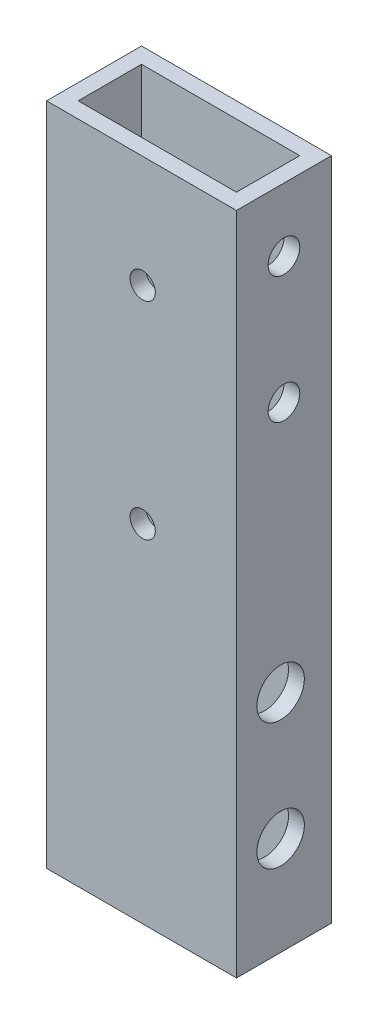
ISO-10303-21;
HEADER;
FILE_DESCRIPTION(('STEP AP214'),'2;1');
FILE_NAME('part.step','',(''),(''),'','','');
FILE_SCHEMA(('AUTOMOTIVE_DESIGN { 1 0 10303 214 1 1 1 1 }'));
ENDSEC;
DATA;
#1=APPLICATION_CONTEXT('core data for automotive mechanical design processes');
#2=APPLICATION_PROTOCOL_DEFINITION('international standard','automotive_design',2000,#1);
#3=PRODUCT_CONTEXT('',#1,'mechanical');
#4=PRODUCT('Part','Part','',(#3));
#5=PRODUCT_RELATED_PRODUCT_CATEGORY('part','',(#4));
#6=PRODUCT_DEFINITION_FORMATION('','',#4);
#7=PRODUCT_DEFINITION_CONTEXT('part definition',#1,'design');
#8=PRODUCT_DEFINITION('design','',#6,#7);
#9=PRODUCT_DEFINITION_SHAPE('','',#8);
#10=(LENGTH_UNIT() NAMED_UNIT(*) SI_UNIT(.MILLI.,.METRE.));
#11=(NAMED_UNIT(*) PLANE_ANGLE_UNIT() SI_UNIT($,.RADIAN.));
#12=(NAMED_UNIT(*) SI_UNIT($,.STERADIAN.) SOLID_ANGLE_UNIT());
#13=UNCERTAINTY_MEASURE_WITH_UNIT(LENGTH_MEASURE(1.E-05),#10,'distance_accuracy_value','');
#14=(GEOMETRIC_REPRESENTATION_CONTEXT(3) GLOBAL_UNCERTAINTY_ASSIGNED_CONTEXT((#13)) GLOBAL_UNIT_ASSIGNED_CONTEXT((#10,
#11,#12)) REPRESENTATION_CONTEXT('',''));
#15=CARTESIAN_POINT('',(0.,0.,0.));
#16=DIRECTION('',(0.,0.,1.));
#17=DIRECTION('',(1.,0.,0.));
#18=AXIS2_PLACEMENT_3D('',#15,#16,#17);
#19=CARTESIAN_POINT('',(0.,133.35,0.));
#20=DIRECTION('',(0.,-1.,0.));
#21=DIRECTION('',(0.,0.,-1.));
#22=AXIS2_PLACEMENT_3D('',#19,#20,#21);
#23=PLANE('',#22);
#24=DIRECTION('',(0.,0.,1.));
#25=VECTOR('',#24,1.);
#26=CARTESIAN_POINT('',(0.,133.35,0.));
#27=LINE('',#26,#25);
#28=CARTESIAN_POINT('',(0.,133.35,-19.05));
#29=VERTEX_POINT('',#28);
#30=CARTESIAN_POINT('',(0.,133.35,0.));
#31=VERTEX_POINT('',#30);
#32=EDGE_CURVE('E170',#29,#31,#27,.T.);
#33=ORIENTED_EDGE('',*,*,#32,.T.);
#34=DIRECTION('',(1.,0.,0.));
#35=VECTOR('',#34,1.);
#36=CARTESIAN_POINT('',(0.,133.35,0.));
#37=LINE('',#36,#35);
#38=CARTESIAN_POINT('',(38.1,133.35,0.));
#39=VERTEX_POINT('',#38);
#40=EDGE_CURVE('E174',#31,#39,#37,.T.);
#41=ORIENTED_EDGE('',*,*,#40,.T.);
#42=DIRECTION('',(0.,0.,-1.));
#43=VECTOR('',#42,1.);
#44=CARTESIAN_POINT('',(38.1,133.35,0.));
#45=LINE('',#44,#43);
#46=CARTESIAN_POINT('',(38.1,133.35,-19.05));
#47=VERTEX_POINT('',#46);
#48=EDGE_CURVE('E178',#39,#47,#45,.T.);
#49=ORIENTED_EDGE('',*,*,#48,.T.);
#50=DIRECTION('',(-1.,0.,0.));
#51=VECTOR('',#50,1.);
#52=CARTESIAN_POINT('',(0.,133.35,-19.05));
#53=LINE('',#52,#51);
#54=EDGE_CURVE('E181',#47,#29,#53,.T.);
#55=ORIENTED_EDGE('',*,*,#54,.T.);
#56=EDGE_LOOP('',(#33,#41,#49,#55));
#57=FACE_BOUND('',#56,.T.);
#58=DIRECTION('',(0.,0.,1.));
#59=VECTOR('',#58,1.);
#60=CARTESIAN_POINT('',(3.175,133.35,-3.175));
#61=LINE('',#60,#59);
#62=CARTESIAN_POINT('',(3.175,133.35,-15.875));
#63=VERTEX_POINT('',#62);
#64=CARTESIAN_POINT('',(3.175,133.35,-3.175));
#65=VERTEX_POINT('',#64);
#66=EDGE_CURVE('E121',#63,#65,#61,.T.);
#67=ORIENTED_EDGE('',*,*,#66,.F.);
#68=DIRECTION('',(-1.,0.,0.));
#69=VECTOR('',#68,1.);
#70=CARTESIAN_POINT('',(3.175,133.35,-15.875));
#71=LINE('',#70,#69);
#72=CARTESIAN_POINT('',(34.925,133.35,-15.875));
#73=VERTEX_POINT('',#72);
#74=EDGE_CURVE('E147',#73,#63,#71,.T.);
#75=ORIENTED_EDGE('',*,*,#74,.F.);
#76=DIRECTION('',(0.,0.,-1.));
#77=VECTOR('',#76,1.);
#78=CARTESIAN_POINT('',(34.925,133.35,-3.175));
#79=LINE('',#78,#77);
#80=CARTESIAN_POINT('',(34.925,133.35,-3.175));
#81=VERTEX_POINT('',#80);
#82=EDGE_CURVE('E143',#81,#73,#79,.T.);
#83=ORIENTED_EDGE('',*,*,#82,.F.);
#84=DIRECTION('',(1.,0.,0.));
#85=VECTOR('',#84,1.);
#86=CARTESIAN_POINT('',(3.175,133.35,-3.175));
#87=LINE('',#86,#85);
#88=EDGE_CURVE('E130',#65,#81,#87,.T.);
#89=ORIENTED_EDGE('',*,*,#88,.F.);
#90=EDGE_LOOP('',(#67,#75,#83,#89));
#91=FACE_BOUND('',#90,.T.);
#92=ADVANCED_FACE('F41',(#57,#91),#23,.F.);
#93=CARTESIAN_POINT('',(0.,0.,0.));
#94=DIRECTION('',(0.,-1.,0.));
#95=DIRECTION('',(0.,0.,-1.));
#96=AXIS2_PLACEMENT_3D('',#93,#94,#95);
#97=PLANE('',#96);
#98=DIRECTION('',(0.,0.,1.));
#99=VECTOR('',#98,1.);
#100=CARTESIAN_POINT('',(0.,0.,0.));
#101=LINE('',#100,#99);
#102=CARTESIAN_POINT('',(0.,0.,-19.05));
#103=VERTEX_POINT('',#102);
#104=CARTESIAN_POINT('',(0.,0.,0.));
#105=VERTEX_POINT('',#104);
#106=EDGE_CURVE('E139',#103,#105,#101,.T.);
#107=ORIENTED_EDGE('',*,*,#106,.F.);
#108=DIRECTION('',(-1.,0.,0.));
#109=VECTOR('',#108,1.);
#110=CARTESIAN_POINT('',(0.,0.,-19.05));
#111=LINE('',#110,#109);
#112=CARTESIAN_POINT('',(38.1,0.,-19.05));
#113=VERTEX_POINT('',#112);
#114=EDGE_CURVE('E175',#113,#103,#111,.T.);
#115=ORIENTED_EDGE('',*,*,#114,.F.);
#116=DIRECTION('',(0.,0.,-1.));
#117=VECTOR('',#116,1.);
#118=CARTESIAN_POINT('',(38.1,0.,0.));
#119=LINE('',#118,#117);
#120=CARTESIAN_POINT('',(38.1,0.,0.));
#121=VERTEX_POINT('',#120);
#122=EDGE_CURVE('E190',#121,#113,#119,.T.);
#123=ORIENTED_EDGE('',*,*,#122,.F.);
#124=DIRECTION('',(1.,0.,0.));
#125=VECTOR('',#124,1.);
#126=CARTESIAN_POINT('',(0.,0.,0.));
#127=LINE('',#126,#125);
#128=EDGE_CURVE('E187',#105,#121,#127,.T.);
#129=ORIENTED_EDGE('',*,*,#128,.F.);
#130=EDGE_LOOP('',(#107,#115,#123,#129));
#131=FACE_BOUND('',#130,.T.);
#132=DIRECTION('',(-1.,0.,0.));
#133=VECTOR('',#132,1.);
#134=CARTESIAN_POINT('',(3.175,0.,-15.875));
#135=LINE('',#134,#133);
#136=CARTESIAN_POINT('',(34.925,0.,-15.875));
#137=VERTEX_POINT('',#136);
#138=CARTESIAN_POINT('',(3.175,0.,-15.875));
#139=VERTEX_POINT('',#138);
#140=EDGE_CURVE('E131',#137,#139,#135,.T.);
#141=ORIENTED_EDGE('',*,*,#140,.T.);
#142=DIRECTION('',(0.,0.,1.));
#143=VECTOR('',#142,1.);
#144=CARTESIAN_POINT('',(3.175,0.,-3.175));
#145=LINE('',#144,#143);
#146=CARTESIAN_POINT('',(3.175,0.,-3.175));
#147=VERTEX_POINT('',#146);
#148=EDGE_CURVE('E70',#139,#147,#145,.T.);
#149=ORIENTED_EDGE('',*,*,#148,.T.);
#150=DIRECTION('',(1.,0.,0.));
#151=VECTOR('',#150,1.);
#152=CARTESIAN_POINT('',(3.175,0.,-3.175));
#153=LINE('',#152,#151);
#154=CARTESIAN_POINT('',(34.925,0.,-3.175));
#155=VERTEX_POINT('',#154);
#156=EDGE_CURVE('E137',#147,#155,#153,.T.);
#157=ORIENTED_EDGE('',*,*,#156,.T.);
#158=DIRECTION('',(0.,0.,-1.));
#159=VECTOR('',#158,1.);
#160=CARTESIAN_POINT('',(34.925,0.,-3.175));
#161=LINE('',#160,#159);
#162=EDGE_CURVE('E157',#155,#137,#161,.T.);
#163=ORIENTED_EDGE('',*,*,#162,.T.);
#164=EDGE_LOOP('',(#141,#149,#157,#163));
#165=FACE_BOUND('',#164,.T.);
#166=ADVANCED_FACE('F310',(#131,#165),#97,.T.);
#167=CARTESIAN_POINT('',(0.,133.35,0.));
#168=DIRECTION('',(1.,0.,0.));
#169=DIRECTION('',(0.,0.,-1.));
#170=AXIS2_PLACEMENT_3D('',#167,#168,#169);
#171=PLANE('',#170);
#172=CARTESIAN_POINT('',(0.,45.1897539067843,-8.85640000000001));
#173=DIRECTION('',(-1.,0.,0.));
#174=DIRECTION('',(0.,0.,1.));
#175=AXIS2_PLACEMENT_3D('',#172,#173,#174);
#176=CIRCLE('',#175,2.01929999999999);
#177=CARTESIAN_POINT('',(0.,45.1897539067843,-6.83710000000003));
#178=VERTEX_POINT('',#177);
#179=EDGE_CURVE('E254',#178,#178,#176,.T.);
#180=ORIENTED_EDGE('',*,*,#179,.F.);
#181=EDGE_LOOP('',(#180));
#182=FACE_BOUND('',#181,.T.);
#183=CARTESIAN_POINT('',(0.,19.7897539067843,-8.85640000000002));
#184=DIRECTION('',(-1.,0.,0.));
#185=DIRECTION('',(0.,0.,1.));
#186=AXIS2_PLACEMENT_3D('',#183,#184,#185);
#187=CIRCLE('',#186,2.01929999999999);
#188=CARTESIAN_POINT('',(0.,19.7897539067843,-6.83710000000003));
#189=VERTEX_POINT('',#188);
#190=EDGE_CURVE('E261',#189,#189,#187,.T.);
#191=ORIENTED_EDGE('',*,*,#190,.F.);
#192=EDGE_LOOP('',(#191));
#193=FACE_BOUND('',#192,.T.);
#194=CARTESIAN_POINT('',(0.,120.65,-9.52500000000011));
#195=DIRECTION('',(1.,0.,0.));
#196=DIRECTION('',(0.,0.,-1.));
#197=AXIS2_PLACEMENT_3D('',#194,#195,#196);
#198=CIRCLE('',#197,3.175);
#199=CARTESIAN_POINT('',(0.,120.65,-12.7000000000001));
#200=VERTEX_POINT('',#199);
#201=EDGE_CURVE('E214',#200,#200,#198,.T.);
#202=ORIENTED_EDGE('',*,*,#201,.T.);
#203=EDGE_LOOP('',(#202));
#204=FACE_BOUND('',#203,.T.);
#205=CARTESIAN_POINT('',(0.,95.25,-9.5250000000001));
#206=DIRECTION('',(1.,0.,0.));
#207=DIRECTION('',(0.,0.,-1.));
#208=AXIS2_PLACEMENT_3D('',#205,#206,#207);
#209=CIRCLE('',#208,3.175);
#210=CARTESIAN_POINT('',(0.,95.25,-12.7000000000001));
#211=VERTEX_POINT('',#210);
#212=EDGE_CURVE('E209',#211,#211,#209,.T.);
#213=ORIENTED_EDGE('',*,*,#212,.T.);
#214=EDGE_LOOP('',(#213));
#215=FACE_BOUND('',#214,.T.);
#216=ORIENTED_EDGE('',*,*,#106,.T.);
#217=DIRECTION('',(0.,-1.,0.));
#218=VECTOR('',#217,1.);
#219=CARTESIAN_POINT('',(0.,133.35,0.));
#220=LINE('',#219,#218);
#221=EDGE_CURVE('E11',#31,#105,#220,.T.);
#222=ORIENTED_EDGE('',*,*,#221,.F.);
#223=ORIENTED_EDGE('',*,*,#32,.F.);
#224=DIRECTION('',(0.,-1.,0.));
#225=VECTOR('',#224,1.);
#226=CARTESIAN_POINT('',(0.,133.35,-19.05));
#227=LINE('',#226,#225);
#228=EDGE_CURVE('E184',#29,#103,#227,.T.);
#229=ORIENTED_EDGE('',*,*,#228,.T.);
#230=EDGE_LOOP('',(#216,#222,#223,#229));
#231=FACE_BOUND('',#230,.T.);
#232=ADVANCED_FACE('F43',(#182,#193,#204,#215,#231),#171,.F.);
#233=CARTESIAN_POINT('',(0.,133.35,0.));
#234=DIRECTION('',(0.,0.,-1.));
#235=DIRECTION('',(-1.,0.,0.));
#236=AXIS2_PLACEMENT_3D('',#233,#234,#235);
#237=PLANE('',#236);
#238=CARTESIAN_POINT('',(19.2722355286807,110.945613606979,0.));
#239=DIRECTION('',(0.,0.,-1.));
#240=DIRECTION('',(-1.,0.,0.));
#241=AXIS2_PLACEMENT_3D('',#238,#239,#240);
#242=CIRCLE('',#241,2.54);
#243=CARTESIAN_POINT('',(16.7322355286807,110.945613606979,0.));
#244=VERTEX_POINT('',#243);
#245=EDGE_CURVE('E328',#244,#244,#242,.T.);
#246=ORIENTED_EDGE('',*,*,#245,.T.);
#247=EDGE_LOOP('',(#246));
#248=FACE_BOUND('',#247,.T.);
#249=CARTESIAN_POINT('',(19.2722355286807,69.4912272139577,0.));
#250=DIRECTION('',(0.,0.,-1.));
#251=DIRECTION('',(-1.,0.,0.));
#252=AXIS2_PLACEMENT_3D('',#249,#250,#251);
#253=CIRCLE('',#252,2.54);
#254=CARTESIAN_POINT('',(16.7322355286807,69.4912272139577,0.));
#255=VERTEX_POINT('',#254);
#256=EDGE_CURVE('E219',#255,#255,#253,.T.);
#257=ORIENTED_EDGE('',*,*,#256,.T.);
#258=EDGE_LOOP('',(#257));
#259=FACE_BOUND('',#258,.T.);
#260=ORIENTED_EDGE('',*,*,#128,.T.);
#261=DIRECTION('',(0.,-1.,0.));
#262=VECTOR('',#261,1.);
#263=CARTESIAN_POINT('',(38.1,133.35,0.));
#264=LINE('',#263,#262);
#265=EDGE_CURVE('E51',#39,#121,#264,.T.);
#266=ORIENTED_EDGE('',*,*,#265,.F.);
#267=ORIENTED_EDGE('',*,*,#40,.F.);
#268=ORIENTED_EDGE('',*,*,#221,.T.);
#269=EDGE_LOOP('',(#260,#266,#267,#268));
#270=FACE_BOUND('',#269,.T.);
#271=ADVANCED_FACE('F319',(#248,#259,#270),#237,.F.);
#272=CARTESIAN_POINT('',(38.1,133.35,0.));
#273=DIRECTION('',(-1.,0.,0.));
#274=DIRECTION('',(0.,0.,1.));
#275=AXIS2_PLACEMENT_3D('',#272,#273,#274);
#276=PLANE('',#275);
#277=CARTESIAN_POINT('',(38.1,19.7897539067843,-8.85640000000002));
#278=DIRECTION('',(-1.,0.,0.));
#279=DIRECTION('',(0.,0.,1.));
#280=AXIS2_PLACEMENT_3D('',#277,#278,#279);
#281=CIRCLE('',#280,4.7625);
#282=CARTESIAN_POINT('',(38.1,19.7897539067843,-4.09390000000002));
#283=VERTEX_POINT('',#282);
#284=EDGE_CURVE('E243',#283,#283,#281,.F.);
#285=ORIENTED_EDGE('',*,*,#284,.F.);
#286=EDGE_LOOP('',(#285));
#287=FACE_BOUND('',#286,.T.);
#288=CARTESIAN_POINT('',(38.1,45.1897539067843,-8.85640000000001));
#289=DIRECTION('',(-1.,0.,0.));
#290=DIRECTION('',(0.,0.,1.));
#291=AXIS2_PLACEMENT_3D('',#288,#289,#290);
#292=CIRCLE('',#291,4.7625);
#293=CARTESIAN_POINT('',(38.1,45.1897539067843,-4.09390000000001));
#294=VERTEX_POINT('',#293);
#295=EDGE_CURVE('E251',#294,#294,#292,.F.);
#296=ORIENTED_EDGE('',*,*,#295,.F.);
#297=EDGE_LOOP('',(#296));
#298=FACE_BOUND('',#297,.T.);
#299=CARTESIAN_POINT('',(38.1,120.65,-9.52500000000011));
#300=DIRECTION('',(1.,0.,0.));
#301=DIRECTION('',(0.,0.,-1.));
#302=AXIS2_PLACEMENT_3D('',#299,#300,#301);
#303=CIRCLE('',#302,3.175);
#304=CARTESIAN_POINT('',(38.1,120.65,-12.7000000000001));
#305=VERTEX_POINT('',#304);
#306=EDGE_CURVE('E267',#305,#305,#303,.T.);
#307=ORIENTED_EDGE('',*,*,#306,.F.);
#308=EDGE_LOOP('',(#307));
#309=FACE_BOUND('',#308,.T.);
#310=CARTESIAN_POINT('',(38.1,95.25,-9.5250000000001));
#311=DIRECTION('',(1.,0.,0.));
#312=DIRECTION('',(0.,0.,-1.));
#313=AXIS2_PLACEMENT_3D('',#310,#311,#312);
#314=CIRCLE('',#313,3.175);
#315=CARTESIAN_POINT('',(38.1,95.25,-12.7000000000001));
#316=VERTEX_POINT('',#315);
#317=EDGE_CURVE('E277',#316,#316,#314,.T.);
#318=ORIENTED_EDGE('',*,*,#317,.F.);
#319=EDGE_LOOP('',(#318));
#320=FACE_BOUND('',#319,.T.);
#321=ORIENTED_EDGE('',*,*,#122,.T.);
#322=DIRECTION('',(0.,-1.,0.));
#323=VECTOR('',#322,1.);
#324=CARTESIAN_POINT('',(38.1,133.35,-19.05));
#325=LINE('',#324,#323);
#326=EDGE_CURVE('E198',#47,#113,#325,.T.);
#327=ORIENTED_EDGE('',*,*,#326,.F.);
#328=ORIENTED_EDGE('',*,*,#48,.F.);
#329=ORIENTED_EDGE('',*,*,#265,.T.);
#330=EDGE_LOOP('',(#321,#327,#328,#329));
#331=FACE_BOUND('',#330,.T.);
#332=ADVANCED_FACE('F303',(#287,#298,#309,#320,#331),#276,.F.);
#333=CARTESIAN_POINT('',(0.,133.35,-19.05));
#334=DIRECTION('',(0.,0.,1.));
#335=DIRECTION('',(1.,0.,0.));
#336=AXIS2_PLACEMENT_3D('',#333,#334,#335);
#337=PLANE('',#336);
#338=CARTESIAN_POINT('',(19.2722355286807,110.945613606979,-19.05));
#339=DIRECTION('',(0.,0.,-1.));
#340=DIRECTION('',(-1.,0.,0.));
#341=AXIS2_PLACEMENT_3D('',#338,#339,#340);
#342=CIRCLE('',#341,2.54);
#343=CARTESIAN_POINT('',(16.7322355286807,110.945613606979,-19.05));
#344=VERTEX_POINT('',#343);
#345=EDGE_CURVE('E399',#344,#344,#342,.T.);
#346=ORIENTED_EDGE('',*,*,#345,.F.);
#347=EDGE_LOOP('',(#346));
#348=FACE_BOUND('',#347,.T.);
#349=CARTESIAN_POINT('',(19.2722355286807,69.4912272139577,-19.05));
#350=DIRECTION('',(0.,0.,-1.));
#351=DIRECTION('',(-1.,0.,0.));
#352=AXIS2_PLACEMENT_3D('',#349,#350,#351);
#353=CIRCLE('',#352,2.54);
#354=CARTESIAN_POINT('',(16.7322355286807,69.4912272139577,-19.05));
#355=VERTEX_POINT('',#354);
#356=EDGE_CURVE('E229',#355,#355,#353,.T.);
#357=ORIENTED_EDGE('',*,*,#356,.F.);
#358=EDGE_LOOP('',(#357));
#359=FACE_BOUND('',#358,.T.);
#360=ORIENTED_EDGE('',*,*,#114,.T.);
#361=ORIENTED_EDGE('',*,*,#228,.F.);
#362=ORIENTED_EDGE('',*,*,#54,.F.);
#363=ORIENTED_EDGE('',*,*,#326,.T.);
#364=EDGE_LOOP('',(#360,#361,#362,#363));
#365=FACE_BOUND('',#364,.T.);
#366=ADVANCED_FACE('F291',(#348,#359,#365),#337,.F.);
#367=CARTESIAN_POINT('',(3.175,133.35,-3.175));
#368=DIRECTION('',(1.,0.,0.));
#369=DIRECTION('',(0.,0.,-1.));
#370=AXIS2_PLACEMENT_3D('',#367,#368,#369);
#371=PLANE('',#370);
#372=CARTESIAN_POINT('',(3.175,45.1897539067843,-8.85640000000001));
#373=DIRECTION('',(1.,0.,0.));
#374=DIRECTION('',(0.,0.,-1.));
#375=AXIS2_PLACEMENT_3D('',#372,#373,#374);
#376=CIRCLE('',#375,2.01929999999999);
#377=CARTESIAN_POINT('',(3.175,45.1897539067843,-10.8757));
#378=VERTEX_POINT('',#377);
#379=EDGE_CURVE('E257',#378,#378,#376,.T.);
#380=ORIENTED_EDGE('',*,*,#379,.F.);
#381=EDGE_LOOP('',(#380));
#382=FACE_BOUND('',#381,.T.);
#383=CARTESIAN_POINT('',(3.175,19.7897539067843,-8.85640000000002));
#384=DIRECTION('',(1.,0.,0.));
#385=DIRECTION('',(0.,0.,-1.));
#386=AXIS2_PLACEMENT_3D('',#383,#384,#385);
#387=CIRCLE('',#386,2.01929999999999);
#388=CARTESIAN_POINT('',(3.175,19.7897539067843,-10.8757));
#389=VERTEX_POINT('',#388);
#390=EDGE_CURVE('E264',#389,#389,#387,.T.);
#391=ORIENTED_EDGE('',*,*,#390,.F.);
#392=EDGE_LOOP('',(#391));
#393=FACE_BOUND('',#392,.T.);
#394=CARTESIAN_POINT('',(3.175,120.65,-9.52500000000011));
#395=DIRECTION('',(1.,0.,0.));
#396=DIRECTION('',(0.,0.,-1.));
#397=AXIS2_PLACEMENT_3D('',#394,#395,#396);
#398=CIRCLE('',#397,3.175);
#399=CARTESIAN_POINT('',(3.175,120.65,-12.7000000000001));
#400=VERTEX_POINT('',#399);
#401=EDGE_CURVE('E213',#400,#400,#398,.T.);
#402=ORIENTED_EDGE('',*,*,#401,.F.);
#403=EDGE_LOOP('',(#402));
#404=FACE_BOUND('',#403,.T.);
#405=CARTESIAN_POINT('',(3.175,95.25,-9.5250000000001));
#406=DIRECTION('',(1.,0.,0.));
#407=DIRECTION('',(0.,0.,-1.));
#408=AXIS2_PLACEMENT_3D('',#405,#406,#407);
#409=CIRCLE('',#408,3.175);
#410=CARTESIAN_POINT('',(3.175,95.25,-12.7000000000001));
#411=VERTEX_POINT('',#410);
#412=EDGE_CURVE('E154',#411,#411,#409,.T.);
#413=ORIENTED_EDGE('',*,*,#412,.F.);
#414=EDGE_LOOP('',(#413));
#415=FACE_BOUND('',#414,.T.);
#416=ORIENTED_EDGE('',*,*,#148,.F.);
#417=DIRECTION('',(0.,-1.,0.));
#418=VECTOR('',#417,1.);
#419=CARTESIAN_POINT('',(3.175,133.35,-15.875));
#420=LINE('',#419,#418);
#421=EDGE_CURVE('E125',#63,#139,#420,.T.);
#422=ORIENTED_EDGE('',*,*,#421,.F.);
#423=ORIENTED_EDGE('',*,*,#66,.T.);
#424=DIRECTION('',(0.,-1.,0.));
#425=VECTOR('',#424,1.);
#426=CARTESIAN_POINT('',(3.175,133.35,-3.175));
#427=LINE('',#426,#425);
#428=EDGE_CURVE('E124',#65,#147,#427,.T.);
#429=ORIENTED_EDGE('',*,*,#428,.T.);
#430=EDGE_LOOP('',(#416,#422,#423,#429));
#431=FACE_BOUND('',#430,.T.);
#432=ADVANCED_FACE('F123',(#382,#393,#404,#415,#431),#371,.T.);
#433=CARTESIAN_POINT('',(3.175,133.35,-3.175));
#434=DIRECTION('',(0.,0.,-1.));
#435=DIRECTION('',(-1.,0.,0.));
#436=AXIS2_PLACEMENT_3D('',#433,#434,#435);
#437=PLANE('',#436);
#438=CARTESIAN_POINT('',(19.2722355286807,110.945613606979,-3.175));
#439=DIRECTION('',(0.,0.,-1.));
#440=DIRECTION('',(-1.,0.,0.));
#441=AXIS2_PLACEMENT_3D('',#438,#439,#440);
#442=CIRCLE('',#441,2.54);
#443=CARTESIAN_POINT('',(16.7322355286807,110.945613606979,-3.175));
#444=VERTEX_POINT('',#443);
#445=EDGE_CURVE('E235',#444,#444,#442,.T.);
#446=ORIENTED_EDGE('',*,*,#445,.F.);
#447=EDGE_LOOP('',(#446));
#448=FACE_BOUND('',#447,.T.);
#449=CARTESIAN_POINT('',(19.2722355286807,69.4912272139577,-3.175));
#450=DIRECTION('',(0.,0.,-1.));
#451=DIRECTION('',(-1.,0.,0.));
#452=AXIS2_PLACEMENT_3D('',#449,#450,#451);
#453=CIRCLE('',#452,2.54);
#454=CARTESIAN_POINT('',(16.7322355286807,69.4912272139577,-3.175));
#455=VERTEX_POINT('',#454);
#456=EDGE_CURVE('E218',#455,#455,#453,.T.);
#457=ORIENTED_EDGE('',*,*,#456,.F.);
#458=EDGE_LOOP('',(#457));
#459=FACE_BOUND('',#458,.T.);
#460=ORIENTED_EDGE('',*,*,#156,.F.);
#461=ORIENTED_EDGE('',*,*,#428,.F.);
#462=ORIENTED_EDGE('',*,*,#88,.T.);
#463=DIRECTION('',(0.,-1.,0.));
#464=VECTOR('',#463,1.);
#465=CARTESIAN_POINT('',(34.925,133.35,-3.175));
#466=LINE('',#465,#464);
#467=EDGE_CURVE('E140',#81,#155,#466,.T.);
#468=ORIENTED_EDGE('',*,*,#467,.T.);
#469=EDGE_LOOP('',(#460,#461,#462,#468));
#470=FACE_BOUND('',#469,.T.);
#471=ADVANCED_FACE('F134',(#448,#459,#470),#437,.T.);
#472=CARTESIAN_POINT('',(34.925,133.35,-3.175));
#473=DIRECTION('',(-1.,0.,0.));
#474=DIRECTION('',(0.,0.,1.));
#475=AXIS2_PLACEMENT_3D('',#472,#473,#474);
#476=PLANE('',#475);
#477=CARTESIAN_POINT('',(34.925,19.7897539067843,-8.85640000000002));
#478=DIRECTION('',(-1.,0.,0.));
#479=DIRECTION('',(0.,0.,1.));
#480=AXIS2_PLACEMENT_3D('',#477,#478,#479);
#481=CIRCLE('',#480,4.7625);
#482=CARTESIAN_POINT('',(34.925,19.7897539067843,-4.09390000000002));
#483=VERTEX_POINT('',#482);
#484=EDGE_CURVE('E225',#483,#483,#481,.T.);
#485=ORIENTED_EDGE('',*,*,#484,.F.);
#486=EDGE_LOOP('',(#485));
#487=FACE_BOUND('',#486,.T.);
#488=CARTESIAN_POINT('',(34.925,45.1897539067843,-8.85640000000001));
#489=DIRECTION('',(-1.,0.,0.));
#490=DIRECTION('',(0.,0.,1.));
#491=AXIS2_PLACEMENT_3D('',#488,#489,#490);
#492=CIRCLE('',#491,4.7625);
#493=CARTESIAN_POINT('',(34.925,45.1897539067843,-4.09390000000001));
#494=VERTEX_POINT('',#493);
#495=EDGE_CURVE('E247',#494,#494,#492,.T.);
#496=ORIENTED_EDGE('',*,*,#495,.F.);
#497=EDGE_LOOP('',(#496));
#498=FACE_BOUND('',#497,.T.);
#499=CARTESIAN_POINT('',(34.925,120.65,-9.52500000000011));
#500=DIRECTION('',(-1.,0.,0.));
#501=DIRECTION('',(0.,0.,1.));
#502=AXIS2_PLACEMENT_3D('',#499,#500,#501);
#503=CIRCLE('',#502,3.175);
#504=CARTESIAN_POINT('',(34.925,120.65,-6.35000000000011));
#505=VERTEX_POINT('',#504);
#506=EDGE_CURVE('E210',#505,#505,#503,.T.);
#507=ORIENTED_EDGE('',*,*,#506,.F.);
#508=EDGE_LOOP('',(#507));
#509=FACE_BOUND('',#508,.T.);
#510=CARTESIAN_POINT('',(34.925,95.25,-9.5250000000001));
#511=DIRECTION('',(-1.,0.,0.));
#512=DIRECTION('',(0.,0.,1.));
#513=AXIS2_PLACEMENT_3D('',#510,#511,#512);
#514=CIRCLE('',#513,3.175);
#515=CARTESIAN_POINT('',(34.925,95.25,-6.35000000000011));
#516=VERTEX_POINT('',#515);
#517=EDGE_CURVE('E205',#516,#516,#514,.T.);
#518=ORIENTED_EDGE('',*,*,#517,.F.);
#519=EDGE_LOOP('',(#518));
#520=FACE_BOUND('',#519,.T.);
#521=ORIENTED_EDGE('',*,*,#162,.F.);
#522=ORIENTED_EDGE('',*,*,#467,.F.);
#523=ORIENTED_EDGE('',*,*,#82,.T.);
#524=DIRECTION('',(0.,-1.,0.));
#525=VECTOR('',#524,1.);
#526=CARTESIAN_POINT('',(34.925,133.35,-15.875));
#527=LINE('',#526,#525);
#528=EDGE_CURVE('E62',#73,#137,#527,.T.);
#529=ORIENTED_EDGE('',*,*,#528,.T.);
#530=EDGE_LOOP('',(#521,#522,#523,#529));
#531=FACE_BOUND('',#530,.T.);
#532=ADVANCED_FACE('F299',(#487,#498,#509,#520,#531),#476,.T.);
#533=CARTESIAN_POINT('',(3.175,133.35,-15.875));
#534=DIRECTION('',(0.,0.,1.));
#535=DIRECTION('',(1.,0.,0.));
#536=AXIS2_PLACEMENT_3D('',#533,#534,#535);
#537=PLANE('',#536);
#538=CARTESIAN_POINT('',(19.2722355286807,110.945613606979,-15.875));
#539=DIRECTION('',(0.,0.,1.));
#540=DIRECTION('',(1.,0.,0.));
#541=AXIS2_PLACEMENT_3D('',#538,#539,#540);
#542=CIRCLE('',#541,2.54);
#543=CARTESIAN_POINT('',(21.8122355286807,110.945613606979,-15.875));
#544=VERTEX_POINT('',#543);
#545=EDGE_CURVE('E45',#544,#544,#542,.T.);
#546=ORIENTED_EDGE('',*,*,#545,.F.);
#547=EDGE_LOOP('',(#546));
#548=FACE_BOUND('',#547,.T.);
#549=CARTESIAN_POINT('',(19.2722355286807,69.4912272139577,-15.875));
#550=DIRECTION('',(0.,0.,1.));
#551=DIRECTION('',(1.,0.,0.));
#552=AXIS2_PLACEMENT_3D('',#549,#550,#551);
#553=CIRCLE('',#552,2.54);
#554=CARTESIAN_POINT('',(21.8122355286807,69.4912272139577,-15.875));
#555=VERTEX_POINT('',#554);
#556=EDGE_CURVE('E215',#555,#555,#553,.T.);
#557=ORIENTED_EDGE('',*,*,#556,.F.);
#558=EDGE_LOOP('',(#557));
#559=FACE_BOUND('',#558,.T.);
#560=ORIENTED_EDGE('',*,*,#140,.F.);
#561=ORIENTED_EDGE('',*,*,#528,.F.);
#562=ORIENTED_EDGE('',*,*,#74,.T.);
#563=ORIENTED_EDGE('',*,*,#421,.T.);
#564=EDGE_LOOP('',(#560,#561,#562,#563));
#565=FACE_BOUND('',#564,.T.);
#566=ADVANCED_FACE('F345',(#548,#559,#565),#537,.T.);
#567=CARTESIAN_POINT('',(0.,95.25,-9.5250000000001));
#568=DIRECTION('',(1.,0.,0.));
#569=DIRECTION('',(0.,0.,-1.));
#570=AXIS2_PLACEMENT_3D('',#567,#568,#569);
#571=CYLINDRICAL_SURFACE('',#570,3.175);
#572=ORIENTED_EDGE('',*,*,#517,.T.);
#573=EDGE_LOOP('',(#572));
#574=FACE_BOUND('',#573,.T.);
#575=ORIENTED_EDGE('',*,*,#317,.T.);
#576=EDGE_LOOP('',(#575));
#577=FACE_BOUND('',#576,.T.);
#578=ADVANCED_FACE('F347',(#574,#577),#571,.F.);
#579=ORIENTED_EDGE('',*,*,#412,.T.);
#580=EDGE_LOOP('',(#579));
#581=FACE_BOUND('',#580,.T.);
#582=ORIENTED_EDGE('',*,*,#212,.F.);
#583=EDGE_LOOP('',(#582));
#584=FACE_BOUND('',#583,.T.);
#585=ADVANCED_FACE('F287',(#581,#584),#571,.F.);
#586=CARTESIAN_POINT('',(0.,120.65,-9.52500000000011));
#587=DIRECTION('',(1.,0.,0.));
#588=DIRECTION('',(0.,0.,-1.));
#589=AXIS2_PLACEMENT_3D('',#586,#587,#588);
#590=CYLINDRICAL_SURFACE('',#589,3.175);
#591=ORIENTED_EDGE('',*,*,#506,.T.);
#592=EDGE_LOOP('',(#591));
#593=FACE_BOUND('',#592,.T.);
#594=ORIENTED_EDGE('',*,*,#306,.T.);
#595=EDGE_LOOP('',(#594));
#596=FACE_BOUND('',#595,.T.);
#597=ADVANCED_FACE('F360',(#593,#596),#590,.F.);
#598=ORIENTED_EDGE('',*,*,#401,.T.);
#599=EDGE_LOOP('',(#598));
#600=FACE_BOUND('',#599,.T.);
#601=ORIENTED_EDGE('',*,*,#201,.F.);
#602=EDGE_LOOP('',(#601));
#603=FACE_BOUND('',#602,.T.);
#604=ADVANCED_FACE('F363',(#600,#603),#590,.F.);
#605=CARTESIAN_POINT('',(38.1,19.7897539067843,-8.85640000000002));
#606=DIRECTION('',(-1.,0.,0.));
#607=DIRECTION('',(0.,0.,1.));
#608=AXIS2_PLACEMENT_3D('',#605,#606,#607);
#609=CYLINDRICAL_SURFACE('',#608,2.01929999999999);
#610=ORIENTED_EDGE('',*,*,#390,.T.);
#611=EDGE_LOOP('',(#610));
#612=FACE_BOUND('',#611,.T.);
#613=ORIENTED_EDGE('',*,*,#190,.T.);
#614=EDGE_LOOP('',(#613));
#615=FACE_BOUND('',#614,.T.);
#616=ADVANCED_FACE('F365',(#612,#615),#609,.F.);
#617=CARTESIAN_POINT('',(38.1,45.1897539067843,-8.85640000000001));
#618=DIRECTION('',(-1.,0.,0.));
#619=DIRECTION('',(0.,0.,1.));
#620=AXIS2_PLACEMENT_3D('',#617,#618,#619);
#621=CYLINDRICAL_SURFACE('',#620,2.01929999999999);
#622=ORIENTED_EDGE('',*,*,#379,.T.);
#623=EDGE_LOOP('',(#622));
#624=FACE_BOUND('',#623,.T.);
#625=ORIENTED_EDGE('',*,*,#179,.T.);
#626=EDGE_LOOP('',(#625));
#627=FACE_BOUND('',#626,.T.);
#628=ADVANCED_FACE('F368',(#624,#627),#621,.F.);
#629=CARTESIAN_POINT('',(38.101,45.1897539067843,-8.85640000000001));
#630=DIRECTION('',(-1.,0.,0.));
#631=DIRECTION('',(0.,0.,1.));
#632=AXIS2_PLACEMENT_3D('',#629,#630,#631);
#633=CYLINDRICAL_SURFACE('',#632,4.7625);
#634=ORIENTED_EDGE('',*,*,#495,.T.);
#635=EDGE_LOOP('',(#634));
#636=FACE_BOUND('',#635,.T.);
#637=ORIENTED_EDGE('',*,*,#295,.T.);
#638=EDGE_LOOP('',(#637));
#639=FACE_BOUND('',#638,.T.);
#640=ADVANCED_FACE('F372',(#636,#639),#633,.F.);
#641=CARTESIAN_POINT('',(38.101,19.7897539067843,-8.85640000000002));
#642=DIRECTION('',(-1.,0.,0.));
#643=DIRECTION('',(0.,0.,1.));
#644=AXIS2_PLACEMENT_3D('',#641,#642,#643);
#645=CYLINDRICAL_SURFACE('',#644,4.7625);
#646=ORIENTED_EDGE('',*,*,#484,.T.);
#647=EDGE_LOOP('',(#646));
#648=FACE_BOUND('',#647,.T.);
#649=ORIENTED_EDGE('',*,*,#284,.T.);
#650=EDGE_LOOP('',(#649));
#651=FACE_BOUND('',#650,.T.);
#652=ADVANCED_FACE('F376',(#648,#651),#645,.F.);
#653=CARTESIAN_POINT('',(19.2722355286807,69.4912272139577,0.));
#654=DIRECTION('',(0.,0.,-1.));
#655=DIRECTION('',(-1.,0.,0.));
#656=AXIS2_PLACEMENT_3D('',#653,#654,#655);
#657=CYLINDRICAL_SURFACE('',#656,2.54);
#658=ORIENTED_EDGE('',*,*,#556,.T.);
#659=EDGE_LOOP('',(#658));
#660=FACE_BOUND('',#659,.T.);
#661=ORIENTED_EDGE('',*,*,#356,.T.);
#662=EDGE_LOOP('',(#661));
#663=FACE_BOUND('',#662,.T.);
#664=ADVANCED_FACE('F380',(#660,#663),#657,.F.);
#665=ORIENTED_EDGE('',*,*,#456,.T.);
#666=EDGE_LOOP('',(#665));
#667=FACE_BOUND('',#666,.T.);
#668=ORIENTED_EDGE('',*,*,#256,.F.);
#669=EDGE_LOOP('',(#668));
#670=FACE_BOUND('',#669,.T.);
#671=ADVANCED_FACE('F384',(#667,#670),#657,.F.);
#672=CARTESIAN_POINT('',(19.2722355286807,110.945613606979,0.));
#673=DIRECTION('',(0.,0.,-1.));
#674=DIRECTION('',(-1.,0.,0.));
#675=AXIS2_PLACEMENT_3D('',#672,#673,#674);
#676=CYLINDRICAL_SURFACE('',#675,2.54);
#677=ORIENTED_EDGE('',*,*,#545,.T.);
#678=EDGE_LOOP('',(#677));
#679=FACE_BOUND('',#678,.T.);
#680=ORIENTED_EDGE('',*,*,#345,.T.);
#681=EDGE_LOOP('',(#680));
#682=FACE_BOUND('',#681,.T.);
#683=ADVANCED_FACE('F385',(#679,#682),#676,.F.);
#684=ORIENTED_EDGE('',*,*,#445,.T.);
#685=EDGE_LOOP('',(#684));
#686=FACE_BOUND('',#685,.T.);
#687=ORIENTED_EDGE('',*,*,#245,.F.);
#688=EDGE_LOOP('',(#687));
#689=FACE_BOUND('',#688,.T.);
#690=ADVANCED_FACE('F387',(#686,#689),#676,.F.);
#691=CLOSED_SHELL('',(#92,#166,#232,#271,#332,#366,#432,#471,#532,#566,#578,#585,#597,#604,#616,
#628,#640,#652,#664,#671,#683,#690));
#692=MANIFOLD_SOLID_BREP('B2',#691);
#693=ADVANCED_BREP_SHAPE_REPRESENTATION('',(#18,#692),#14);
#694=SHAPE_DEFINITION_REPRESENTATION(#9,#693);
ENDSEC;
END-ISO-10303-21;
